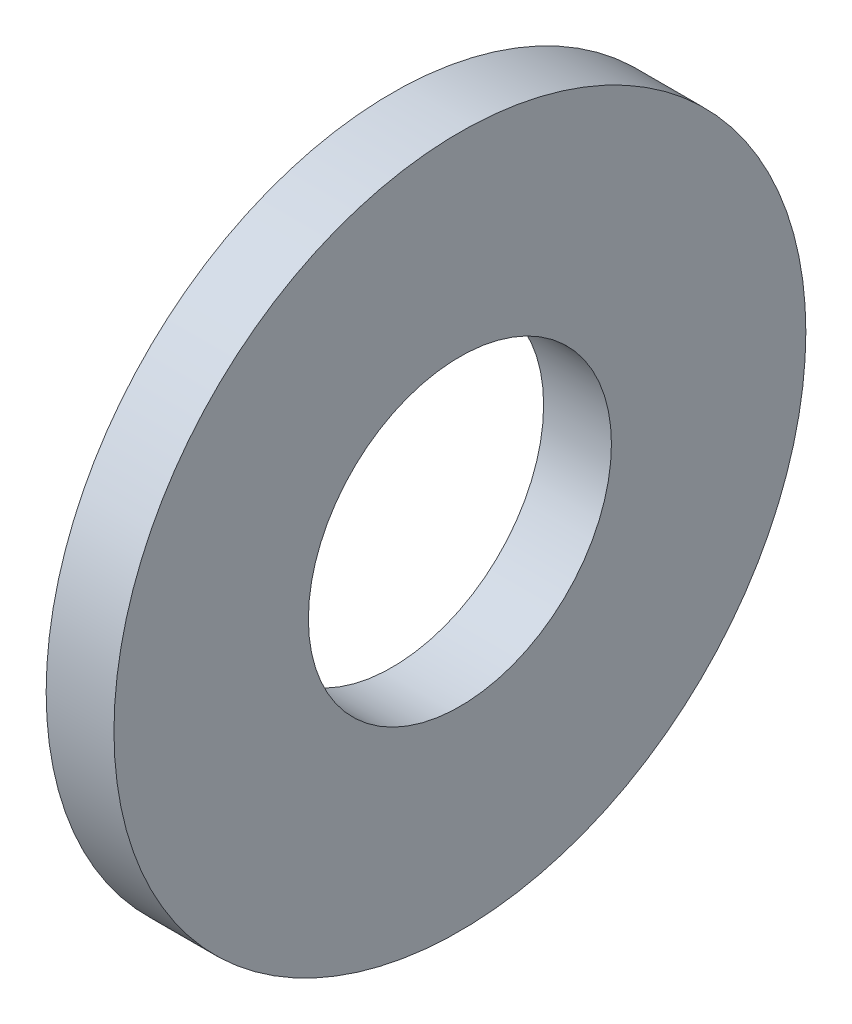
ISO-10303-21;
HEADER;
FILE_DESCRIPTION(('STEP AP214'),'2;1');
FILE_NAME('part.step','',(''),(''),'','','');
FILE_SCHEMA(('AUTOMOTIVE_DESIGN { 1 0 10303 214 1 1 1 1 }'));
ENDSEC;
DATA;
#1=APPLICATION_CONTEXT('core data for automotive mechanical design processes');
#2=APPLICATION_PROTOCOL_DEFINITION('international standard','automotive_design',2000,#1);
#3=PRODUCT_CONTEXT('',#1,'mechanical');
#4=PRODUCT('Part','Part','',(#3));
#5=PRODUCT_RELATED_PRODUCT_CATEGORY('part','',(#4));
#6=PRODUCT_DEFINITION_FORMATION('','',#4);
#7=PRODUCT_DEFINITION_CONTEXT('part definition',#1,'design');
#8=PRODUCT_DEFINITION('design','',#6,#7);
#9=PRODUCT_DEFINITION_SHAPE('','',#8);
#10=(LENGTH_UNIT() NAMED_UNIT(*) SI_UNIT(.MILLI.,.METRE.));
#11=(NAMED_UNIT(*) PLANE_ANGLE_UNIT() SI_UNIT($,.RADIAN.));
#12=(NAMED_UNIT(*) SI_UNIT($,.STERADIAN.) SOLID_ANGLE_UNIT());
#13=UNCERTAINTY_MEASURE_WITH_UNIT(LENGTH_MEASURE(1.E-05),#10,'distance_accuracy_value','');
#14=(GEOMETRIC_REPRESENTATION_CONTEXT(3) GLOBAL_UNCERTAINTY_ASSIGNED_CONTEXT((#13)) GLOBAL_UNIT_ASSIGNED_CONTEXT((#10,
#11,#12)) REPRESENTATION_CONTEXT('',''));
#15=CARTESIAN_POINT('',(0.,0.,0.));
#16=DIRECTION('',(0.,0.,1.));
#17=DIRECTION('',(1.,0.,0.));
#18=AXIS2_PLACEMENT_3D('',#15,#16,#17);
#19=CARTESIAN_POINT('',(-34.9249999999999,0.,0.));
#20=DIRECTION('',(-1.,0.,0.));
#21=DIRECTION('',(0.,0.,1.));
#22=AXIS2_PLACEMENT_3D('',#19,#20,#21);
#23=CYLINDRICAL_SURFACE('',#22,2.7813);
#24=CARTESIAN_POINT('',(0.,0.,0.));
#25=DIRECTION('',(-1.,0.,0.));
#26=DIRECTION('',(0.,0.,1.));
#27=AXIS2_PLACEMENT_3D('',#24,#25,#26);
#28=CIRCLE('',#27,2.7813);
#29=CARTESIAN_POINT('',(0.,0.,2.7813));
#30=VERTEX_POINT('',#29);
#31=EDGE_CURVE('E10',#30,#30,#28,.T.);
#32=ORIENTED_EDGE('',*,*,#31,.F.);
#33=EDGE_LOOP('',(#32));
#34=FACE_BOUND('',#33,.T.);
#35=CARTESIAN_POINT('',(-1.2446,0.,0.));
#36=DIRECTION('',(-1.,0.,0.));
#37=DIRECTION('',(0.,0.,1.));
#38=AXIS2_PLACEMENT_3D('',#35,#36,#37);
#39=CIRCLE('',#38,2.7813);
#40=CARTESIAN_POINT('',(-1.2446,0.,2.7813));
#41=VERTEX_POINT('',#40);
#42=EDGE_CURVE('E45',#41,#41,#39,.T.);
#43=ORIENTED_EDGE('',*,*,#42,.T.);
#44=EDGE_LOOP('',(#43));
#45=FACE_BOUND('',#44,.T.);
#46=ADVANCED_FACE('F31',(#34,#45),#23,.F.);
#47=CARTESIAN_POINT('',(0.,2.7813,0.));
#48=DIRECTION('',(-1.,0.,0.));
#49=DIRECTION('',(0.,0.,1.));
#50=AXIS2_PLACEMENT_3D('',#47,#48,#49);
#51=PLANE('',#50);
#52=CARTESIAN_POINT('',(0.,0.,0.));
#53=DIRECTION('',(-1.,0.,0.));
#54=DIRECTION('',(0.,0.,1.));
#55=AXIS2_PLACEMENT_3D('',#52,#53,#54);
#56=CIRCLE('',#55,6.35);
#57=CARTESIAN_POINT('',(0.,0.,6.35));
#58=VERTEX_POINT('',#57);
#59=EDGE_CURVE('E37',#58,#58,#56,.T.);
#60=ORIENTED_EDGE('',*,*,#59,.F.);
#61=EDGE_LOOP('',(#60));
#62=FACE_BOUND('',#61,.T.);
#63=ORIENTED_EDGE('',*,*,#31,.T.);
#64=EDGE_LOOP('',(#63));
#65=FACE_BOUND('',#64,.T.);
#66=ADVANCED_FACE('F60',(#62,#65),#51,.F.);
#67=CARTESIAN_POINT('',(-34.9249999999999,0.,0.));
#68=DIRECTION('',(-1.,0.,0.));
#69=DIRECTION('',(0.,0.,1.));
#70=AXIS2_PLACEMENT_3D('',#67,#68,#69);
#71=CYLINDRICAL_SURFACE('',#70,6.35);
#72=CARTESIAN_POINT('',(-1.2446,0.,0.));
#73=DIRECTION('',(-1.,0.,0.));
#74=DIRECTION('',(0.,0.,1.));
#75=AXIS2_PLACEMENT_3D('',#72,#73,#74);
#76=CIRCLE('',#75,6.35);
#77=CARTESIAN_POINT('',(-1.2446,0.,6.35));
#78=VERTEX_POINT('',#77);
#79=EDGE_CURVE('E41',#78,#78,#76,.T.);
#80=ORIENTED_EDGE('',*,*,#79,.F.);
#81=EDGE_LOOP('',(#80));
#82=FACE_BOUND('',#81,.T.);
#83=ORIENTED_EDGE('',*,*,#59,.T.);
#84=EDGE_LOOP('',(#83));
#85=FACE_BOUND('',#84,.T.);
#86=ADVANCED_FACE('F55',(#82,#85),#71,.T.);
#87=CARTESIAN_POINT('',(-1.2446,6.35,0.));
#88=DIRECTION('',(1.,0.,0.));
#89=DIRECTION('',(0.,0.,-1.));
#90=AXIS2_PLACEMENT_3D('',#87,#88,#89);
#91=PLANE('',#90);
#92=ORIENTED_EDGE('',*,*,#42,.F.);
#93=EDGE_LOOP('',(#92));
#94=FACE_BOUND('',#93,.T.);
#95=ORIENTED_EDGE('',*,*,#79,.T.);
#96=EDGE_LOOP('',(#95));
#97=FACE_BOUND('',#96,.T.);
#98=ADVANCED_FACE('F52',(#94,#97),#91,.F.);
#99=CLOSED_SHELL('',(#46,#66,#86,#98));
#100=MANIFOLD_SOLID_BREP('B2',#99);
#101=ADVANCED_BREP_SHAPE_REPRESENTATION('',(#18,#100),#14);
#102=SHAPE_DEFINITION_REPRESENTATION(#9,#101);
ENDSEC;
END-ISO-10303-21;
